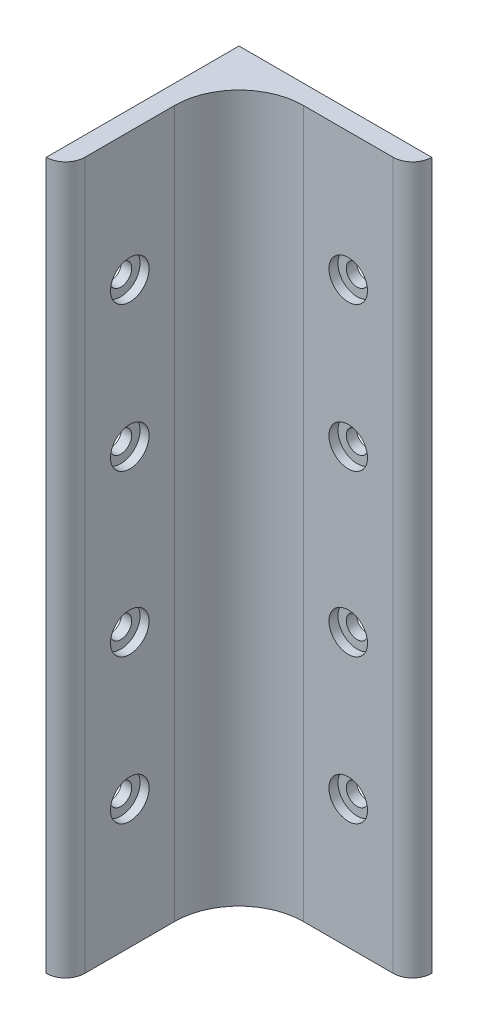
ISO-10303-21;
HEADER;
FILE_DESCRIPTION(('STEP AP214'),'2;1');
FILE_NAME('part.step','',(''),(''),'','','');
FILE_SCHEMA(('AUTOMOTIVE_DESIGN { 1 0 10303 214 1 1 1 1 }'));
ENDSEC;
DATA;
#1=APPLICATION_CONTEXT('core data for automotive mechanical design processes');
#2=APPLICATION_PROTOCOL_DEFINITION('international standard','automotive_design',2000,#1);
#3=PRODUCT_CONTEXT('',#1,'mechanical');
#4=PRODUCT('Part','Part','',(#3));
#5=PRODUCT_RELATED_PRODUCT_CATEGORY('part','',(#4));
#6=PRODUCT_DEFINITION_FORMATION('','',#4);
#7=PRODUCT_DEFINITION_CONTEXT('part definition',#1,'design');
#8=PRODUCT_DEFINITION('design','',#6,#7);
#9=PRODUCT_DEFINITION_SHAPE('','',#8);
#10=(LENGTH_UNIT() NAMED_UNIT(*) SI_UNIT(.MILLI.,.METRE.));
#11=(NAMED_UNIT(*) PLANE_ANGLE_UNIT() SI_UNIT($,.RADIAN.));
#12=(NAMED_UNIT(*) SI_UNIT($,.STERADIAN.) SOLID_ANGLE_UNIT());
#13=UNCERTAINTY_MEASURE_WITH_UNIT(LENGTH_MEASURE(1.E-05),#10,'distance_accuracy_value','');
#14=(GEOMETRIC_REPRESENTATION_CONTEXT(3) GLOBAL_UNCERTAINTY_ASSIGNED_CONTEXT((#13)) GLOBAL_UNIT_ASSIGNED_CONTEXT((#10,
#11,#12)) REPRESENTATION_CONTEXT('',''));
#15=CARTESIAN_POINT('',(0.,0.,0.));
#16=DIRECTION('',(0.,0.,1.));
#17=DIRECTION('',(1.,0.,0.));
#18=AXIS2_PLACEMENT_3D('',#15,#16,#17);
#19=CARTESIAN_POINT('',(0.,42.5,20.));
#20=DIRECTION('',(1.,0.,0.));
#21=DIRECTION('',(0.,0.,-1.));
#22=AXIS2_PLACEMENT_3D('',#19,#20,#21);
#23=CYLINDRICAL_SURFACE('',#22,1.7);
#24=CARTESIAN_POINT('',(0.,42.5,20.));
#25=DIRECTION('',(1.,0.,0.));
#26=DIRECTION('',(0.,0.,-1.));
#27=AXIS2_PLACEMENT_3D('',#24,#25,#26);
#28=CIRCLE('',#27,1.7);
#29=CARTESIAN_POINT('',(0.,42.5,18.3));
#30=VERTEX_POINT('',#29);
#31=EDGE_CURVE('E188',#30,#30,#28,.T.);
#32=ORIENTED_EDGE('',*,*,#31,.F.);
#33=EDGE_LOOP('',(#32));
#34=FACE_BOUND('',#33,.T.);
#35=CARTESIAN_POINT('',(1.6,42.5,20.));
#36=DIRECTION('',(1.,0.,0.));
#37=DIRECTION('',(0.,0.,-1.));
#38=AXIS2_PLACEMENT_3D('',#35,#36,#37);
#39=CIRCLE('',#38,1.7);
#40=CARTESIAN_POINT('',(1.6,42.5,18.3));
#41=VERTEX_POINT('',#40);
#42=EDGE_CURVE('E163',#41,#41,#39,.F.);
#43=ORIENTED_EDGE('',*,*,#42,.F.);
#44=EDGE_LOOP('',(#43));
#45=FACE_BOUND('',#44,.T.);
#46=ADVANCED_FACE('F33',(#34,#45),#23,.F.);
#47=CARTESIAN_POINT('',(0.,90.,20.));
#48=DIRECTION('',(1.,0.,0.));
#49=DIRECTION('',(0.,0.,-1.));
#50=AXIS2_PLACEMENT_3D('',#47,#48,#49);
#51=CYLINDRICAL_SURFACE('',#50,1.7);
#52=CARTESIAN_POINT('',(0.,90.,20.));
#53=DIRECTION('',(1.,0.,0.));
#54=DIRECTION('',(0.,0.,-1.));
#55=AXIS2_PLACEMENT_3D('',#52,#53,#54);
#56=CIRCLE('',#55,1.7);
#57=CARTESIAN_POINT('',(0.,90.,18.3));
#58=VERTEX_POINT('',#57);
#59=EDGE_CURVE('E181',#58,#58,#56,.T.);
#60=ORIENTED_EDGE('',*,*,#59,.F.);
#61=EDGE_LOOP('',(#60));
#62=FACE_BOUND('',#61,.T.);
#63=CARTESIAN_POINT('',(1.6,90.,20.));
#64=DIRECTION('',(1.,0.,0.));
#65=DIRECTION('',(0.,0.,-1.));
#66=AXIS2_PLACEMENT_3D('',#63,#64,#65);
#67=CIRCLE('',#66,1.7);
#68=CARTESIAN_POINT('',(1.6,90.,18.3));
#69=VERTEX_POINT('',#68);
#70=EDGE_CURVE('E157',#69,#69,#67,.F.);
#71=ORIENTED_EDGE('',*,*,#70,.F.);
#72=EDGE_LOOP('',(#71));
#73=FACE_BOUND('',#72,.T.);
#74=ADVANCED_FACE('F237',(#62,#73),#51,.F.);
#75=CARTESIAN_POINT('',(20.,42.5,0.));
#76=DIRECTION('',(0.,0.,1.));
#77=DIRECTION('',(1.,0.,0.));
#78=AXIS2_PLACEMENT_3D('',#75,#76,#77);
#79=CYLINDRICAL_SURFACE('',#78,1.7);
#80=CARTESIAN_POINT('',(20.,42.5,0.));
#81=DIRECTION('',(0.,0.,1.));
#82=DIRECTION('',(1.,0.,0.));
#83=AXIS2_PLACEMENT_3D('',#80,#81,#82);
#84=CIRCLE('',#83,1.7);
#85=CARTESIAN_POINT('',(21.7,42.5,0.));
#86=VERTEX_POINT('',#85);
#87=EDGE_CURVE('E199',#86,#86,#84,.T.);
#88=ORIENTED_EDGE('',*,*,#87,.F.);
#89=EDGE_LOOP('',(#88));
#90=FACE_BOUND('',#89,.T.);
#91=CARTESIAN_POINT('',(20.,42.5,1.6));
#92=DIRECTION('',(0.,0.,1.));
#93=DIRECTION('',(1.,0.,0.));
#94=AXIS2_PLACEMENT_3D('',#91,#92,#93);
#95=CIRCLE('',#94,1.7);
#96=CARTESIAN_POINT('',(21.7,42.5,1.6));
#97=VERTEX_POINT('',#96);
#98=EDGE_CURVE('E150',#97,#97,#95,.F.);
#99=ORIENTED_EDGE('',*,*,#98,.F.);
#100=EDGE_LOOP('',(#99));
#101=FACE_BOUND('',#100,.T.);
#102=ADVANCED_FACE('F243',(#90,#101),#79,.F.);
#103=CARTESIAN_POINT('',(20.,90.,0.));
#104=DIRECTION('',(0.,0.,1.));
#105=DIRECTION('',(1.,0.,0.));
#106=AXIS2_PLACEMENT_3D('',#103,#104,#105);
#107=CYLINDRICAL_SURFACE('',#106,1.7);
#108=CARTESIAN_POINT('',(20.,90.,0.));
#109=DIRECTION('',(0.,0.,1.));
#110=DIRECTION('',(1.,0.,0.));
#111=AXIS2_PLACEMENT_3D('',#108,#109,#110);
#112=CIRCLE('',#111,1.7);
#113=CARTESIAN_POINT('',(21.7,90.,0.));
#114=VERTEX_POINT('',#113);
#115=EDGE_CURVE('E193',#114,#114,#112,.T.);
#116=ORIENTED_EDGE('',*,*,#115,.F.);
#117=EDGE_LOOP('',(#116));
#118=FACE_BOUND('',#117,.T.);
#119=CARTESIAN_POINT('',(20.,90.,1.6));
#120=DIRECTION('',(0.,0.,1.));
#121=DIRECTION('',(1.,0.,0.));
#122=AXIS2_PLACEMENT_3D('',#119,#120,#121);
#123=CIRCLE('',#122,1.7);
#124=CARTESIAN_POINT('',(21.7,90.,1.6));
#125=VERTEX_POINT('',#124);
#126=EDGE_CURVE('E143',#125,#125,#123,.F.);
#127=ORIENTED_EDGE('',*,*,#126,.F.);
#128=EDGE_LOOP('',(#127));
#129=FACE_BOUND('',#128,.T.);
#130=ADVANCED_FACE('F254',(#118,#129),#107,.F.);
#131=CARTESIAN_POINT('',(0.,110.,0.));
#132=DIRECTION('',(0.,0.,1.));
#133=DIRECTION('',(1.,0.,0.));
#134=AXIS2_PLACEMENT_3D('',#131,#132,#133);
#135=PLANE('',#134);
#136=ORIENTED_EDGE('',*,*,#115,.T.);
#137=EDGE_LOOP('',(#136));
#138=FACE_BOUND('',#137,.T.);
#139=CARTESIAN_POINT('',(20.,67.5,0.));
#140=DIRECTION('',(0.,0.,1.));
#141=DIRECTION('',(-1.,0.,0.));
#142=AXIS2_PLACEMENT_3D('',#139,#140,#141);
#143=CIRCLE('',#142,1.7);
#144=CARTESIAN_POINT('',(18.3,67.5,0.));
#145=VERTEX_POINT('',#144);
#146=EDGE_CURVE('E196',#145,#145,#143,.T.);
#147=ORIENTED_EDGE('',*,*,#146,.T.);
#148=EDGE_LOOP('',(#147));
#149=FACE_BOUND('',#148,.T.);
#150=ORIENTED_EDGE('',*,*,#87,.T.);
#151=EDGE_LOOP('',(#150));
#152=FACE_BOUND('',#151,.T.);
#153=CARTESIAN_POINT('',(20.,20.,0.));
#154=DIRECTION('',(0.,0.,1.));
#155=DIRECTION('',(-1.,0.,0.));
#156=AXIS2_PLACEMENT_3D('',#153,#154,#155);
#157=CIRCLE('',#156,1.7);
#158=CARTESIAN_POINT('',(18.3,20.,0.));
#159=VERTEX_POINT('',#158);
#160=EDGE_CURVE('E184',#159,#159,#157,.T.);
#161=ORIENTED_EDGE('',*,*,#160,.T.);
#162=EDGE_LOOP('',(#161));
#163=FACE_BOUND('',#162,.T.);
#164=DIRECTION('',(-1.,0.,0.));
#165=VECTOR('',#164,1.);
#166=CARTESIAN_POINT('',(0.,0.,0.));
#167=LINE('',#166,#165);
#168=CARTESIAN_POINT('',(30.,0.,0.));
#169=VERTEX_POINT('',#168);
#170=CARTESIAN_POINT('',(0.,0.,0.));
#171=VERTEX_POINT('',#170);
#172=EDGE_CURVE('E118',#169,#171,#167,.T.);
#173=ORIENTED_EDGE('',*,*,#172,.T.);
#174=DIRECTION('',(0.,-1.,0.));
#175=VECTOR('',#174,1.);
#176=CARTESIAN_POINT('',(0.,110.,0.));
#177=LINE('',#176,#175);
#178=CARTESIAN_POINT('',(0.,110.,0.));
#179=VERTEX_POINT('',#178);
#180=EDGE_CURVE('E99',#179,#171,#177,.T.);
#181=ORIENTED_EDGE('',*,*,#180,.F.);
#182=DIRECTION('',(-1.,0.,0.));
#183=VECTOR('',#182,1.);
#184=CARTESIAN_POINT('',(0.,110.,0.));
#185=LINE('',#184,#183);
#186=CARTESIAN_POINT('',(30.,110.,0.));
#187=VERTEX_POINT('',#186);
#188=EDGE_CURVE('E106',#187,#179,#185,.T.);
#189=ORIENTED_EDGE('',*,*,#188,.F.);
#190=DIRECTION('',(0.,-1.,0.));
#191=VECTOR('',#190,1.);
#192=CARTESIAN_POINT('',(30.,110.,0.));
#193=LINE('',#192,#191);
#194=EDGE_CURVE('E124',#187,#169,#193,.T.);
#195=ORIENTED_EDGE('',*,*,#194,.T.);
#196=EDGE_LOOP('',(#173,#181,#189,#195));
#197=FACE_BOUND('',#196,.T.);
#198=ADVANCED_FACE('F117',(#138,#149,#152,#163,#197),#135,.F.);
#199=CARTESIAN_POINT('',(0.,110.,0.));
#200=DIRECTION('',(1.,0.,0.));
#201=DIRECTION('',(0.,0.,-1.));
#202=AXIS2_PLACEMENT_3D('',#199,#200,#201);
#203=PLANE('',#202);
#204=ORIENTED_EDGE('',*,*,#59,.T.);
#205=EDGE_LOOP('',(#204));
#206=FACE_BOUND('',#205,.T.);
#207=CARTESIAN_POINT('',(0.,67.5,20.));
#208=DIRECTION('',(1.,0.,0.));
#209=DIRECTION('',(0.,0.,1.));
#210=AXIS2_PLACEMENT_3D('',#207,#208,#209);
#211=CIRCLE('',#210,1.7);
#212=CARTESIAN_POINT('',(0.,67.5,21.7));
#213=VERTEX_POINT('',#212);
#214=EDGE_CURVE('E185',#213,#213,#211,.T.);
#215=ORIENTED_EDGE('',*,*,#214,.T.);
#216=EDGE_LOOP('',(#215));
#217=FACE_BOUND('',#216,.T.);
#218=ORIENTED_EDGE('',*,*,#31,.T.);
#219=EDGE_LOOP('',(#218));
#220=FACE_BOUND('',#219,.T.);
#221=CARTESIAN_POINT('',(0.,20.,20.));
#222=DIRECTION('',(1.,0.,0.));
#223=DIRECTION('',(0.,0.,1.));
#224=AXIS2_PLACEMENT_3D('',#221,#222,#223);
#225=CIRCLE('',#224,1.7);
#226=CARTESIAN_POINT('',(0.,20.,21.7));
#227=VERTEX_POINT('',#226);
#228=EDGE_CURVE('E156',#227,#227,#225,.T.);
#229=ORIENTED_EDGE('',*,*,#228,.T.);
#230=EDGE_LOOP('',(#229));
#231=FACE_BOUND('',#230,.T.);
#232=DIRECTION('',(0.,0.,1.));
#233=VECTOR('',#232,1.);
#234=CARTESIAN_POINT('',(0.,0.,0.));
#235=LINE('',#234,#233);
#236=CARTESIAN_POINT('',(0.,0.,30.));
#237=VERTEX_POINT('',#236);
#238=EDGE_CURVE('E208',#171,#237,#235,.T.);
#239=ORIENTED_EDGE('',*,*,#238,.T.);
#240=DIRECTION('',(0.,-1.,0.));
#241=VECTOR('',#240,1.);
#242=CARTESIAN_POINT('',(0.,110.,30.));
#243=LINE('',#242,#241);
#244=CARTESIAN_POINT('',(0.,110.,30.));
#245=VERTEX_POINT('',#244);
#246=EDGE_CURVE('E102',#245,#237,#243,.T.);
#247=ORIENTED_EDGE('',*,*,#246,.F.);
#248=DIRECTION('',(0.,0.,1.));
#249=VECTOR('',#248,1.);
#250=CARTESIAN_POINT('',(0.,110.,0.));
#251=LINE('',#250,#249);
#252=EDGE_CURVE('E94',#179,#245,#251,.T.);
#253=ORIENTED_EDGE('',*,*,#252,.F.);
#254=ORIENTED_EDGE('',*,*,#180,.T.);
#255=EDGE_LOOP('',(#239,#247,#253,#254));
#256=FACE_BOUND('',#255,.T.);
#257=ADVANCED_FACE('F97',(#206,#217,#220,#231,#256),#203,.F.);
#258=CARTESIAN_POINT('',(3.,110.,30.));
#259=DIRECTION('',(-1.,0.,0.));
#260=DIRECTION('',(0.,0.,1.));
#261=AXIS2_PLACEMENT_3D('',#258,#259,#260);
#262=PLANE('',#261);
#263=CARTESIAN_POINT('',(3.,90.,20.));
#264=DIRECTION('',(1.,0.,0.));
#265=DIRECTION('',(0.,0.,-1.));
#266=AXIS2_PLACEMENT_3D('',#263,#264,#265);
#267=CIRCLE('',#266,3.);
#268=CARTESIAN_POINT('',(3.,90.,17.));
#269=VERTEX_POINT('',#268);
#270=EDGE_CURVE('E599',#269,#269,#267,.T.);
#271=ORIENTED_EDGE('',*,*,#270,.F.);
#272=EDGE_LOOP('',(#271));
#273=FACE_BOUND('',#272,.T.);
#274=CARTESIAN_POINT('',(3.,67.5,20.));
#275=DIRECTION('',(1.,0.,0.));
#276=DIRECTION('',(0.,0.,1.));
#277=AXIS2_PLACEMENT_3D('',#274,#275,#276);
#278=CIRCLE('',#277,3.);
#279=CARTESIAN_POINT('',(3.,67.5,23.));
#280=VERTEX_POINT('',#279);
#281=EDGE_CURVE('E593',#280,#280,#278,.T.);
#282=ORIENTED_EDGE('',*,*,#281,.F.);
#283=EDGE_LOOP('',(#282));
#284=FACE_BOUND('',#283,.T.);
#285=CARTESIAN_POINT('',(3.,42.5,20.));
#286=DIRECTION('',(1.,0.,0.));
#287=DIRECTION('',(0.,0.,-1.));
#288=AXIS2_PLACEMENT_3D('',#285,#286,#287);
#289=CIRCLE('',#288,3.);
#290=CARTESIAN_POINT('',(3.,42.5,17.));
#291=VERTEX_POINT('',#290);
#292=EDGE_CURVE('E542',#291,#291,#289,.T.);
#293=ORIENTED_EDGE('',*,*,#292,.F.);
#294=EDGE_LOOP('',(#293));
#295=FACE_BOUND('',#294,.T.);
#296=CARTESIAN_POINT('',(3.,20.,20.));
#297=DIRECTION('',(1.,0.,0.));
#298=DIRECTION('',(0.,0.,1.));
#299=AXIS2_PLACEMENT_3D('',#296,#297,#298);
#300=CIRCLE('',#299,3.);
#301=CARTESIAN_POINT('',(3.,20.,23.));
#302=VERTEX_POINT('',#301);
#303=EDGE_CURVE('E539',#302,#302,#300,.T.);
#304=ORIENTED_EDGE('',*,*,#303,.F.);
#305=EDGE_LOOP('',(#304));
#306=FACE_BOUND('',#305,.T.);
#307=DIRECTION('',(0.,0.,-1.));
#308=VECTOR('',#307,1.);
#309=CARTESIAN_POINT('',(3.,110.,30.));
#310=LINE('',#309,#308);
#311=CARTESIAN_POINT('',(3.,110.,27.));
#312=VERTEX_POINT('',#311);
#313=CARTESIAN_POINT('',(3.,110.,13.));
#314=VERTEX_POINT('',#313);
#315=EDGE_CURVE('E105',#312,#314,#310,.T.);
#316=ORIENTED_EDGE('',*,*,#315,.F.);
#317=DIRECTION('',(0.,-1.,0.));
#318=VECTOR('',#317,1.);
#319=CARTESIAN_POINT('',(3.,110.,27.));
#320=LINE('',#319,#318);
#321=CARTESIAN_POINT('',(3.,0.,27.));
#322=VERTEX_POINT('',#321);
#323=EDGE_CURVE('E135',#312,#322,#320,.T.);
#324=ORIENTED_EDGE('',*,*,#323,.T.);
#325=DIRECTION('',(0.,0.,-1.));
#326=VECTOR('',#325,1.);
#327=CARTESIAN_POINT('',(3.,0.,30.));
#328=LINE('',#327,#326);
#329=CARTESIAN_POINT('',(3.,0.,13.));
#330=VERTEX_POINT('',#329);
#331=EDGE_CURVE('E210',#322,#330,#328,.T.);
#332=ORIENTED_EDGE('',*,*,#331,.T.);
#333=DIRECTION('',(0.,-1.,0.));
#334=VECTOR('',#333,1.);
#335=CARTESIAN_POINT('',(3.,110.,13.));
#336=LINE('',#335,#334);
#337=EDGE_CURVE('E122',#330,#314,#336,.F.);
#338=ORIENTED_EDGE('',*,*,#337,.T.);
#339=EDGE_LOOP('',(#316,#324,#332,#338));
#340=FACE_BOUND('',#339,.T.);
#341=ADVANCED_FACE('F220',(#273,#284,#295,#306,#340),#262,.F.);
#342=CARTESIAN_POINT('',(3.,110.,3.));
#343=DIRECTION('',(0.,0.,-1.));
#344=DIRECTION('',(-1.,0.,0.));
#345=AXIS2_PLACEMENT_3D('',#342,#343,#344);
#346=PLANE('',#345);
#347=CARTESIAN_POINT('',(20.,90.,3.));
#348=DIRECTION('',(0.,0.,1.));
#349=DIRECTION('',(1.,0.,0.));
#350=AXIS2_PLACEMENT_3D('',#347,#348,#349);
#351=CIRCLE('',#350,3.);
#352=CARTESIAN_POINT('',(23.,90.,3.));
#353=VERTEX_POINT('',#352);
#354=EDGE_CURVE('E548',#353,#353,#351,.T.);
#355=ORIENTED_EDGE('',*,*,#354,.F.);
#356=EDGE_LOOP('',(#355));
#357=FACE_BOUND('',#356,.T.);
#358=CARTESIAN_POINT('',(20.,67.5,3.));
#359=DIRECTION('',(0.,0.,1.));
#360=DIRECTION('',(-1.,0.,0.));
#361=AXIS2_PLACEMENT_3D('',#358,#359,#360);
#362=CIRCLE('',#361,3.);
#363=CARTESIAN_POINT('',(17.,67.5,3.));
#364=VERTEX_POINT('',#363);
#365=EDGE_CURVE('E554',#364,#364,#362,.T.);
#366=ORIENTED_EDGE('',*,*,#365,.F.);
#367=EDGE_LOOP('',(#366));
#368=FACE_BOUND('',#367,.T.);
#369=CARTESIAN_POINT('',(20.,42.5,3.));
#370=DIRECTION('',(0.,0.,1.));
#371=DIRECTION('',(1.,0.,0.));
#372=AXIS2_PLACEMENT_3D('',#369,#370,#371);
#373=CIRCLE('',#372,3.);
#374=CARTESIAN_POINT('',(23.,42.5,3.));
#375=VERTEX_POINT('',#374);
#376=EDGE_CURVE('E177',#375,#375,#373,.T.);
#377=ORIENTED_EDGE('',*,*,#376,.F.);
#378=EDGE_LOOP('',(#377));
#379=FACE_BOUND('',#378,.T.);
#380=CARTESIAN_POINT('',(20.,20.,3.));
#381=DIRECTION('',(0.,0.,1.));
#382=DIRECTION('',(-1.,0.,0.));
#383=AXIS2_PLACEMENT_3D('',#380,#381,#382);
#384=CIRCLE('',#383,3.);
#385=CARTESIAN_POINT('',(17.,20.,3.));
#386=VERTEX_POINT('',#385);
#387=EDGE_CURVE('E168',#386,#386,#384,.T.);
#388=ORIENTED_EDGE('',*,*,#387,.F.);
#389=EDGE_LOOP('',(#388));
#390=FACE_BOUND('',#389,.T.);
#391=DIRECTION('',(1.,0.,0.));
#392=VECTOR('',#391,1.);
#393=CARTESIAN_POINT('',(3.,0.,3.));
#394=LINE('',#393,#392);
#395=CARTESIAN_POINT('',(13.,0.,3.));
#396=VERTEX_POINT('',#395);
#397=CARTESIAN_POINT('',(27.,0.,3.));
#398=VERTEX_POINT('',#397);
#399=EDGE_CURVE('E115',#396,#398,#394,.T.);
#400=ORIENTED_EDGE('',*,*,#399,.T.);
#401=DIRECTION('',(0.,-1.,0.));
#402=VECTOR('',#401,1.);
#403=CARTESIAN_POINT('',(27.,110.,3.));
#404=LINE('',#403,#402);
#405=CARTESIAN_POINT('',(27.,110.,3.));
#406=VERTEX_POINT('',#405);
#407=EDGE_CURVE('E11',#398,#406,#404,.F.);
#408=ORIENTED_EDGE('',*,*,#407,.T.);
#409=DIRECTION('',(1.,0.,0.));
#410=VECTOR('',#409,1.);
#411=CARTESIAN_POINT('',(3.,110.,3.));
#412=LINE('',#411,#410);
#413=CARTESIAN_POINT('',(13.,110.,3.));
#414=VERTEX_POINT('',#413);
#415=EDGE_CURVE('E205',#414,#406,#412,.T.);
#416=ORIENTED_EDGE('',*,*,#415,.F.);
#417=DIRECTION('',(0.,-1.,0.));
#418=VECTOR('',#417,1.);
#419=CARTESIAN_POINT('',(13.,0.,3.));
#420=LINE('',#419,#418);
#421=EDGE_CURVE('E119',#414,#396,#420,.T.);
#422=ORIENTED_EDGE('',*,*,#421,.T.);
#423=EDGE_LOOP('',(#400,#408,#416,#422));
#424=FACE_BOUND('',#423,.T.);
#425=ADVANCED_FACE('F226',(#357,#368,#379,#390,#424),#346,.F.);
#426=CARTESIAN_POINT('',(0.,110.,0.));
#427=DIRECTION('',(0.,1.,0.));
#428=DIRECTION('',(0.,0.,1.));
#429=AXIS2_PLACEMENT_3D('',#426,#427,#428);
#430=PLANE('',#429);
#431=ORIENTED_EDGE('',*,*,#252,.T.);
#432=CARTESIAN_POINT('',(0.,110.,27.));
#433=DIRECTION('',(0.,1.,0.));
#434=DIRECTION('',(0.,0.,1.));
#435=AXIS2_PLACEMENT_3D('',#432,#433,#434);
#436=CIRCLE('',#435,3.);
#437=EDGE_CURVE('E42',#245,#312,#436,.T.);
#438=ORIENTED_EDGE('',*,*,#437,.T.);
#439=ORIENTED_EDGE('',*,*,#315,.T.);
#440=CARTESIAN_POINT('',(13.,110.,13.));
#441=DIRECTION('',(0.,1.,0.));
#442=DIRECTION('',(0.,0.,1.));
#443=AXIS2_PLACEMENT_3D('',#440,#441,#442);
#444=CIRCLE('',#443,10.);
#445=EDGE_CURVE('E133',#314,#414,#444,.F.);
#446=ORIENTED_EDGE('',*,*,#445,.T.);
#447=ORIENTED_EDGE('',*,*,#415,.T.);
#448=CARTESIAN_POINT('',(27.,110.,0.));
#449=DIRECTION('',(0.,1.,0.));
#450=DIRECTION('',(0.,0.,1.));
#451=AXIS2_PLACEMENT_3D('',#448,#449,#450);
#452=CIRCLE('',#451,3.);
#453=EDGE_CURVE('E111',#406,#187,#452,.T.);
#454=ORIENTED_EDGE('',*,*,#453,.T.);
#455=ORIENTED_EDGE('',*,*,#188,.T.);
#456=EDGE_LOOP('',(#431,#438,#439,#446,#447,#454,#455));
#457=FACE_BOUND('',#456,.T.);
#458=ADVANCED_FACE('F109',(#457),#430,.T.);
#459=CARTESIAN_POINT('',(0.,0.,0.));
#460=DIRECTION('',(0.,1.,0.));
#461=DIRECTION('',(0.,0.,1.));
#462=AXIS2_PLACEMENT_3D('',#459,#460,#461);
#463=PLANE('',#462);
#464=ORIENTED_EDGE('',*,*,#331,.F.);
#465=CARTESIAN_POINT('',(0.,0.,27.));
#466=DIRECTION('',(0.,1.,0.));
#467=DIRECTION('',(0.,0.,1.));
#468=AXIS2_PLACEMENT_3D('',#465,#466,#467);
#469=CIRCLE('',#468,3.);
#470=EDGE_CURVE('E139',#322,#237,#469,.F.);
#471=ORIENTED_EDGE('',*,*,#470,.T.);
#472=ORIENTED_EDGE('',*,*,#238,.F.);
#473=ORIENTED_EDGE('',*,*,#172,.F.);
#474=CARTESIAN_POINT('',(27.,0.,0.));
#475=DIRECTION('',(0.,1.,0.));
#476=DIRECTION('',(0.,0.,1.));
#477=AXIS2_PLACEMENT_3D('',#474,#475,#476);
#478=CIRCLE('',#477,3.);
#479=EDGE_CURVE('E56',#169,#398,#478,.F.);
#480=ORIENTED_EDGE('',*,*,#479,.T.);
#481=ORIENTED_EDGE('',*,*,#399,.F.);
#482=CARTESIAN_POINT('',(13.,0.,13.));
#483=DIRECTION('',(0.,1.,0.));
#484=DIRECTION('',(0.,0.,1.));
#485=AXIS2_PLACEMENT_3D('',#482,#483,#484);
#486=CIRCLE('',#485,10.);
#487=EDGE_CURVE('E130',#396,#330,#486,.T.);
#488=ORIENTED_EDGE('',*,*,#487,.T.);
#489=EDGE_LOOP('',(#464,#471,#472,#473,#480,#481,#488));
#490=FACE_BOUND('',#489,.T.);
#491=ADVANCED_FACE('F214',(#490),#463,.F.);
#492=CARTESIAN_POINT('',(13.,110.,13.));
#493=DIRECTION('',(0.,1.,0.));
#494=DIRECTION('',(0.,0.,1.));
#495=AXIS2_PLACEMENT_3D('',#492,#493,#494);
#496=CYLINDRICAL_SURFACE('',#495,10.);
#497=ORIENTED_EDGE('',*,*,#445,.F.);
#498=ORIENTED_EDGE('',*,*,#337,.F.);
#499=ORIENTED_EDGE('',*,*,#487,.F.);
#500=ORIENTED_EDGE('',*,*,#421,.F.);
#501=EDGE_LOOP('',(#497,#498,#499,#500));
#502=FACE_BOUND('',#501,.T.);
#503=ADVANCED_FACE('F225',(#502),#496,.F.);
#504=CARTESIAN_POINT('',(0.,110.,27.));
#505=DIRECTION('',(0.,-1.,0.));
#506=DIRECTION('',(0.,0.,-1.));
#507=AXIS2_PLACEMENT_3D('',#504,#505,#506);
#508=CYLINDRICAL_SURFACE('',#507,3.);
#509=ORIENTED_EDGE('',*,*,#437,.F.);
#510=ORIENTED_EDGE('',*,*,#246,.T.);
#511=ORIENTED_EDGE('',*,*,#470,.F.);
#512=ORIENTED_EDGE('',*,*,#323,.F.);
#513=EDGE_LOOP('',(#509,#510,#511,#512));
#514=FACE_BOUND('',#513,.T.);
#515=ADVANCED_FACE('F216',(#514),#508,.T.);
#516=CARTESIAN_POINT('',(27.,110.,0.));
#517=DIRECTION('',(0.,-1.,0.));
#518=DIRECTION('',(0.,0.,-1.));
#519=AXIS2_PLACEMENT_3D('',#516,#517,#518);
#520=CYLINDRICAL_SURFACE('',#519,3.);
#521=ORIENTED_EDGE('',*,*,#453,.F.);
#522=ORIENTED_EDGE('',*,*,#407,.F.);
#523=ORIENTED_EDGE('',*,*,#479,.F.);
#524=ORIENTED_EDGE('',*,*,#194,.F.);
#525=EDGE_LOOP('',(#521,#522,#523,#524));
#526=FACE_BOUND('',#525,.T.);
#527=ADVANCED_FACE('F35',(#526),#520,.T.);
#528=CARTESIAN_POINT('',(20.,20.,0.));
#529=DIRECTION('',(0.,0.,1.));
#530=DIRECTION('',(1.,0.,0.));
#531=AXIS2_PLACEMENT_3D('',#528,#529,#530);
#532=CYLINDRICAL_SURFACE('',#531,1.7);
#533=CARTESIAN_POINT('',(20.,20.,1.6));
#534=DIRECTION('',(0.,0.,-1.));
#535=DIRECTION('',(-1.,0.,0.));
#536=AXIS2_PLACEMENT_3D('',#533,#534,#535);
#537=CIRCLE('',#536,1.7);
#538=CARTESIAN_POINT('',(18.3,20.,1.6));
#539=VERTEX_POINT('',#538);
#540=EDGE_CURVE('E153',#539,#539,#537,.F.);
#541=ORIENTED_EDGE('',*,*,#540,.T.);
#542=EDGE_LOOP('',(#541));
#543=FACE_BOUND('',#542,.T.);
#544=ORIENTED_EDGE('',*,*,#160,.F.);
#545=EDGE_LOOP('',(#544));
#546=FACE_BOUND('',#545,.T.);
#547=ADVANCED_FACE('F228',(#543,#546),#532,.F.);
#548=CARTESIAN_POINT('',(20.,67.5,0.));
#549=DIRECTION('',(0.,0.,1.));
#550=DIRECTION('',(1.,0.,0.));
#551=AXIS2_PLACEMENT_3D('',#548,#549,#550);
#552=CYLINDRICAL_SURFACE('',#551,1.7);
#553=CARTESIAN_POINT('',(20.,67.5,1.6));
#554=DIRECTION('',(0.,0.,-1.));
#555=DIRECTION('',(-1.,0.,0.));
#556=AXIS2_PLACEMENT_3D('',#553,#554,#555);
#557=CIRCLE('',#556,1.7);
#558=CARTESIAN_POINT('',(18.3,67.5,1.6));
#559=VERTEX_POINT('',#558);
#560=EDGE_CURVE('E146',#559,#559,#557,.F.);
#561=ORIENTED_EDGE('',*,*,#560,.T.);
#562=EDGE_LOOP('',(#561));
#563=FACE_BOUND('',#562,.T.);
#564=ORIENTED_EDGE('',*,*,#146,.F.);
#565=EDGE_LOOP('',(#564));
#566=FACE_BOUND('',#565,.T.);
#567=ADVANCED_FACE('F233',(#563,#566),#552,.F.);
#568=CARTESIAN_POINT('',(0.,20.,20.));
#569=DIRECTION('',(1.,0.,0.));
#570=DIRECTION('',(0.,0.,-1.));
#571=AXIS2_PLACEMENT_3D('',#568,#569,#570);
#572=CYLINDRICAL_SURFACE('',#571,1.7);
#573=CARTESIAN_POINT('',(1.6,20.,20.));
#574=DIRECTION('',(-1.,0.,0.));
#575=DIRECTION('',(0.,0.,1.));
#576=AXIS2_PLACEMENT_3D('',#573,#574,#575);
#577=CIRCLE('',#576,1.7);
#578=CARTESIAN_POINT('',(1.6,20.,21.7));
#579=VERTEX_POINT('',#578);
#580=EDGE_CURVE('E37',#579,#579,#577,.F.);
#581=ORIENTED_EDGE('',*,*,#580,.T.);
#582=EDGE_LOOP('',(#581));
#583=FACE_BOUND('',#582,.T.);
#584=ORIENTED_EDGE('',*,*,#228,.F.);
#585=EDGE_LOOP('',(#584));
#586=FACE_BOUND('',#585,.T.);
#587=ADVANCED_FACE('F251',(#583,#586),#572,.F.);
#588=CARTESIAN_POINT('',(0.,67.5,20.));
#589=DIRECTION('',(1.,0.,0.));
#590=DIRECTION('',(0.,0.,-1.));
#591=AXIS2_PLACEMENT_3D('',#588,#589,#590);
#592=CYLINDRICAL_SURFACE('',#591,1.7);
#593=CARTESIAN_POINT('',(1.6,67.5,20.));
#594=DIRECTION('',(-1.,0.,0.));
#595=DIRECTION('',(0.,0.,1.));
#596=AXIS2_PLACEMENT_3D('',#593,#594,#595);
#597=CIRCLE('',#596,1.7);
#598=CARTESIAN_POINT('',(1.6,67.5,21.7));
#599=VERTEX_POINT('',#598);
#600=EDGE_CURVE('E160',#599,#599,#597,.F.);
#601=ORIENTED_EDGE('',*,*,#600,.T.);
#602=EDGE_LOOP('',(#601));
#603=FACE_BOUND('',#602,.T.);
#604=ORIENTED_EDGE('',*,*,#214,.F.);
#605=EDGE_LOOP('',(#604));
#606=FACE_BOUND('',#605,.T.);
#607=ADVANCED_FACE('F250',(#603,#606),#592,.F.);
#608=CARTESIAN_POINT('',(20.,90.,1.6));
#609=DIRECTION('',(0.,0.,1.));
#610=DIRECTION('',(1.,0.,0.));
#611=AXIS2_PLACEMENT_3D('',#608,#609,#610);
#612=PLANE('',#611);
#613=CARTESIAN_POINT('',(20.,90.,1.6));
#614=DIRECTION('',(0.,0.,1.));
#615=DIRECTION('',(1.,0.,0.));
#616=AXIS2_PLACEMENT_3D('',#613,#614,#615);
#617=CIRCLE('',#616,3.);
#618=CARTESIAN_POINT('',(23.,90.,1.6));
#619=VERTEX_POINT('',#618);
#620=EDGE_CURVE('E147',#619,#619,#617,.T.);
#621=ORIENTED_EDGE('',*,*,#620,.T.);
#622=EDGE_LOOP('',(#621));
#623=FACE_BOUND('',#622,.T.);
#624=ORIENTED_EDGE('',*,*,#126,.T.);
#625=EDGE_LOOP('',(#624));
#626=FACE_BOUND('',#625,.T.);
#627=ADVANCED_FACE('F348',(#623,#626),#612,.T.);
#628=CARTESIAN_POINT('',(20.,90.,1.6));
#629=DIRECTION('',(0.,0.,1.));
#630=DIRECTION('',(1.,0.,0.));
#631=AXIS2_PLACEMENT_3D('',#628,#629,#630);
#632=CYLINDRICAL_SURFACE('',#631,3.);
#633=ORIENTED_EDGE('',*,*,#620,.F.);
#634=EDGE_LOOP('',(#633));
#635=FACE_BOUND('',#634,.T.);
#636=ORIENTED_EDGE('',*,*,#354,.T.);
#637=EDGE_LOOP('',(#636));
#638=FACE_BOUND('',#637,.T.);
#639=ADVANCED_FACE('F352',(#635,#638),#632,.F.);
#640=CARTESIAN_POINT('',(20.,67.5,1.6));
#641=DIRECTION('',(0.,0.,-1.));
#642=DIRECTION('',(-1.,0.,0.));
#643=AXIS2_PLACEMENT_3D('',#640,#641,#642);
#644=PLANE('',#643);
#645=CARTESIAN_POINT('',(20.,67.5,1.6));
#646=DIRECTION('',(0.,0.,1.));
#647=DIRECTION('',(-1.,0.,0.));
#648=AXIS2_PLACEMENT_3D('',#645,#646,#647);
#649=CIRCLE('',#648,3.);
#650=CARTESIAN_POINT('',(17.,67.5,1.6));
#651=VERTEX_POINT('',#650);
#652=EDGE_CURVE('E551',#651,#651,#649,.T.);
#653=ORIENTED_EDGE('',*,*,#652,.T.);
#654=EDGE_LOOP('',(#653));
#655=FACE_BOUND('',#654,.T.);
#656=ORIENTED_EDGE('',*,*,#560,.F.);
#657=EDGE_LOOP('',(#656));
#658=FACE_BOUND('',#657,.T.);
#659=ADVANCED_FACE('F363',(#655,#658),#644,.F.);
#660=CARTESIAN_POINT('',(20.,67.5,1.6));
#661=DIRECTION('',(0.,0.,1.));
#662=DIRECTION('',(1.,0.,0.));
#663=AXIS2_PLACEMENT_3D('',#660,#661,#662);
#664=CYLINDRICAL_SURFACE('',#663,3.);
#665=ORIENTED_EDGE('',*,*,#652,.F.);
#666=EDGE_LOOP('',(#665));
#667=FACE_BOUND('',#666,.T.);
#668=ORIENTED_EDGE('',*,*,#365,.T.);
#669=EDGE_LOOP('',(#668));
#670=FACE_BOUND('',#669,.T.);
#671=ADVANCED_FACE('F373',(#667,#670),#664,.F.);
#672=CARTESIAN_POINT('',(20.,42.5,1.6));
#673=DIRECTION('',(0.,0.,1.));
#674=DIRECTION('',(1.,0.,0.));
#675=AXIS2_PLACEMENT_3D('',#672,#673,#674);
#676=PLANE('',#675);
#677=CARTESIAN_POINT('',(20.,42.5,1.6));
#678=DIRECTION('',(0.,0.,1.));
#679=DIRECTION('',(1.,0.,0.));
#680=AXIS2_PLACEMENT_3D('',#677,#678,#679);
#681=CIRCLE('',#680,3.);
#682=CARTESIAN_POINT('',(23.,42.5,1.6));
#683=VERTEX_POINT('',#682);
#684=EDGE_CURVE('E557',#683,#683,#681,.T.);
#685=ORIENTED_EDGE('',*,*,#684,.T.);
#686=EDGE_LOOP('',(#685));
#687=FACE_BOUND('',#686,.T.);
#688=ORIENTED_EDGE('',*,*,#98,.T.);
#689=EDGE_LOOP('',(#688));
#690=FACE_BOUND('',#689,.T.);
#691=ADVANCED_FACE('F383',(#687,#690),#676,.T.);
#692=CARTESIAN_POINT('',(20.,42.5,1.6));
#693=DIRECTION('',(0.,0.,1.));
#694=DIRECTION('',(1.,0.,0.));
#695=AXIS2_PLACEMENT_3D('',#692,#693,#694);
#696=CYLINDRICAL_SURFACE('',#695,3.);
#697=ORIENTED_EDGE('',*,*,#684,.F.);
#698=EDGE_LOOP('',(#697));
#699=FACE_BOUND('',#698,.T.);
#700=ORIENTED_EDGE('',*,*,#376,.T.);
#701=EDGE_LOOP('',(#700));
#702=FACE_BOUND('',#701,.T.);
#703=ADVANCED_FACE('F393',(#699,#702),#696,.F.);
#704=CARTESIAN_POINT('',(20.,20.,1.6));
#705=DIRECTION('',(0.,0.,-1.));
#706=DIRECTION('',(-1.,0.,0.));
#707=AXIS2_PLACEMENT_3D('',#704,#705,#706);
#708=PLANE('',#707);
#709=CARTESIAN_POINT('',(20.,20.,1.6));
#710=DIRECTION('',(0.,0.,1.));
#711=DIRECTION('',(-1.,0.,0.));
#712=AXIS2_PLACEMENT_3D('',#709,#710,#711);
#713=CIRCLE('',#712,3.);
#714=CARTESIAN_POINT('',(17.,20.,1.6));
#715=VERTEX_POINT('',#714);
#716=EDGE_CURVE('E172',#715,#715,#713,.T.);
#717=ORIENTED_EDGE('',*,*,#716,.T.);
#718=EDGE_LOOP('',(#717));
#719=FACE_BOUND('',#718,.T.);
#720=ORIENTED_EDGE('',*,*,#540,.F.);
#721=EDGE_LOOP('',(#720));
#722=FACE_BOUND('',#721,.T.);
#723=ADVANCED_FACE('F403',(#719,#722),#708,.F.);
#724=CARTESIAN_POINT('',(20.,20.,1.6));
#725=DIRECTION('',(0.,0.,1.));
#726=DIRECTION('',(1.,0.,0.));
#727=AXIS2_PLACEMENT_3D('',#724,#725,#726);
#728=CYLINDRICAL_SURFACE('',#727,3.);
#729=ORIENTED_EDGE('',*,*,#716,.F.);
#730=EDGE_LOOP('',(#729));
#731=FACE_BOUND('',#730,.T.);
#732=ORIENTED_EDGE('',*,*,#387,.T.);
#733=EDGE_LOOP('',(#732));
#734=FACE_BOUND('',#733,.T.);
#735=ADVANCED_FACE('F413',(#731,#734),#728,.F.);
#736=CARTESIAN_POINT('',(1.6,90.,20.));
#737=DIRECTION('',(1.,0.,0.));
#738=DIRECTION('',(0.,0.,-1.));
#739=AXIS2_PLACEMENT_3D('',#736,#737,#738);
#740=PLANE('',#739);
#741=CARTESIAN_POINT('',(1.6,90.,20.));
#742=DIRECTION('',(1.,0.,0.));
#743=DIRECTION('',(0.,0.,-1.));
#744=AXIS2_PLACEMENT_3D('',#741,#742,#743);
#745=CIRCLE('',#744,3.);
#746=CARTESIAN_POINT('',(1.6,90.,17.));
#747=VERTEX_POINT('',#746);
#748=EDGE_CURVE('E161',#747,#747,#745,.T.);
#749=ORIENTED_EDGE('',*,*,#748,.T.);
#750=EDGE_LOOP('',(#749));
#751=FACE_BOUND('',#750,.T.);
#752=ORIENTED_EDGE('',*,*,#70,.T.);
#753=EDGE_LOOP('',(#752));
#754=FACE_BOUND('',#753,.T.);
#755=ADVANCED_FACE('F422',(#751,#754),#740,.T.);
#756=CARTESIAN_POINT('',(1.6,90.,20.));
#757=DIRECTION('',(1.,0.,0.));
#758=DIRECTION('',(0.,0.,-1.));
#759=AXIS2_PLACEMENT_3D('',#756,#757,#758);
#760=CYLINDRICAL_SURFACE('',#759,3.);
#761=ORIENTED_EDGE('',*,*,#748,.F.);
#762=EDGE_LOOP('',(#761));
#763=FACE_BOUND('',#762,.T.);
#764=ORIENTED_EDGE('',*,*,#270,.T.);
#765=EDGE_LOOP('',(#764));
#766=FACE_BOUND('',#765,.T.);
#767=ADVANCED_FACE('F459',(#763,#766),#760,.F.);
#768=CARTESIAN_POINT('',(1.6,67.5,20.));
#769=DIRECTION('',(-1.,0.,0.));
#770=DIRECTION('',(0.,0.,1.));
#771=AXIS2_PLACEMENT_3D('',#768,#769,#770);
#772=PLANE('',#771);
#773=CARTESIAN_POINT('',(1.6,67.5,20.));
#774=DIRECTION('',(1.,0.,0.));
#775=DIRECTION('',(0.,0.,1.));
#776=AXIS2_PLACEMENT_3D('',#773,#774,#775);
#777=CIRCLE('',#776,3.);
#778=CARTESIAN_POINT('',(1.6,67.5,23.));
#779=VERTEX_POINT('',#778);
#780=EDGE_CURVE('E596',#779,#779,#777,.T.);
#781=ORIENTED_EDGE('',*,*,#780,.T.);
#782=EDGE_LOOP('',(#781));
#783=FACE_BOUND('',#782,.T.);
#784=ORIENTED_EDGE('',*,*,#600,.F.);
#785=EDGE_LOOP('',(#784));
#786=FACE_BOUND('',#785,.T.);
#787=ADVANCED_FACE('F469',(#783,#786),#772,.F.);
#788=CARTESIAN_POINT('',(1.6,67.5,20.));
#789=DIRECTION('',(1.,0.,0.));
#790=DIRECTION('',(0.,0.,-1.));
#791=AXIS2_PLACEMENT_3D('',#788,#789,#790);
#792=CYLINDRICAL_SURFACE('',#791,3.);
#793=ORIENTED_EDGE('',*,*,#780,.F.);
#794=EDGE_LOOP('',(#793));
#795=FACE_BOUND('',#794,.T.);
#796=ORIENTED_EDGE('',*,*,#281,.T.);
#797=EDGE_LOOP('',(#796));
#798=FACE_BOUND('',#797,.T.);
#799=ADVANCED_FACE('F479',(#795,#798),#792,.F.);
#800=CARTESIAN_POINT('',(1.6,42.5,20.));
#801=DIRECTION('',(1.,0.,0.));
#802=DIRECTION('',(0.,0.,-1.));
#803=AXIS2_PLACEMENT_3D('',#800,#801,#802);
#804=PLANE('',#803);
#805=CARTESIAN_POINT('',(1.6,42.5,20.));
#806=DIRECTION('',(1.,0.,0.));
#807=DIRECTION('',(0.,0.,-1.));
#808=AXIS2_PLACEMENT_3D('',#805,#806,#807);
#809=CIRCLE('',#808,3.);
#810=CARTESIAN_POINT('',(1.6,42.5,17.));
#811=VERTEX_POINT('',#810);
#812=EDGE_CURVE('E590',#811,#811,#809,.T.);
#813=ORIENTED_EDGE('',*,*,#812,.T.);
#814=EDGE_LOOP('',(#813));
#815=FACE_BOUND('',#814,.T.);
#816=ORIENTED_EDGE('',*,*,#42,.T.);
#817=EDGE_LOOP('',(#816));
#818=FACE_BOUND('',#817,.T.);
#819=ADVANCED_FACE('F489',(#815,#818),#804,.T.);
#820=CARTESIAN_POINT('',(1.6,42.5,20.));
#821=DIRECTION('',(1.,0.,0.));
#822=DIRECTION('',(0.,0.,-1.));
#823=AXIS2_PLACEMENT_3D('',#820,#821,#822);
#824=CYLINDRICAL_SURFACE('',#823,3.);
#825=ORIENTED_EDGE('',*,*,#812,.F.);
#826=EDGE_LOOP('',(#825));
#827=FACE_BOUND('',#826,.T.);
#828=ORIENTED_EDGE('',*,*,#292,.T.);
#829=EDGE_LOOP('',(#828));
#830=FACE_BOUND('',#829,.T.);
#831=ADVANCED_FACE('F499',(#827,#830),#824,.F.);
#832=CARTESIAN_POINT('',(1.6,20.,20.));
#833=DIRECTION('',(-1.,0.,0.));
#834=DIRECTION('',(0.,0.,1.));
#835=AXIS2_PLACEMENT_3D('',#832,#833,#834);
#836=PLANE('',#835);
#837=CARTESIAN_POINT('',(1.6,20.,20.));
#838=DIRECTION('',(1.,0.,0.));
#839=DIRECTION('',(0.,0.,1.));
#840=AXIS2_PLACEMENT_3D('',#837,#838,#839);
#841=CIRCLE('',#840,3.);
#842=CARTESIAN_POINT('',(1.6,20.,23.));
#843=VERTEX_POINT('',#842);
#844=EDGE_CURVE('E536',#843,#843,#841,.T.);
#845=ORIENTED_EDGE('',*,*,#844,.T.);
#846=EDGE_LOOP('',(#845));
#847=FACE_BOUND('',#846,.T.);
#848=ORIENTED_EDGE('',*,*,#580,.F.);
#849=EDGE_LOOP('',(#848));
#850=FACE_BOUND('',#849,.T.);
#851=ADVANCED_FACE('F509',(#847,#850),#836,.F.);
#852=CARTESIAN_POINT('',(1.6,20.,20.));
#853=DIRECTION('',(1.,0.,0.));
#854=DIRECTION('',(0.,0.,-1.));
#855=AXIS2_PLACEMENT_3D('',#852,#853,#854);
#856=CYLINDRICAL_SURFACE('',#855,3.);
#857=ORIENTED_EDGE('',*,*,#844,.F.);
#858=EDGE_LOOP('',(#857));
#859=FACE_BOUND('',#858,.T.);
#860=ORIENTED_EDGE('',*,*,#303,.T.);
#861=EDGE_LOOP('',(#860));
#862=FACE_BOUND('',#861,.T.);
#863=ADVANCED_FACE('F519',(#859,#862),#856,.F.);
#864=CLOSED_SHELL('',(#46,#74,#102,#130,#198,#257,#341,#425,#458,#491,#503,#515,#527,#547,#567,
#587,#607,#627,#639,#659,#671,#691,#703,#723,#735,#755,#767,#787,#799,#819,#831,#851,#863));
#865=MANIFOLD_SOLID_BREP('B2',#864);
#866=ADVANCED_BREP_SHAPE_REPRESENTATION('',(#18,#865),#14);
#867=SHAPE_DEFINITION_REPRESENTATION(#9,#866);
ENDSEC;
END-ISO-10303-21;
